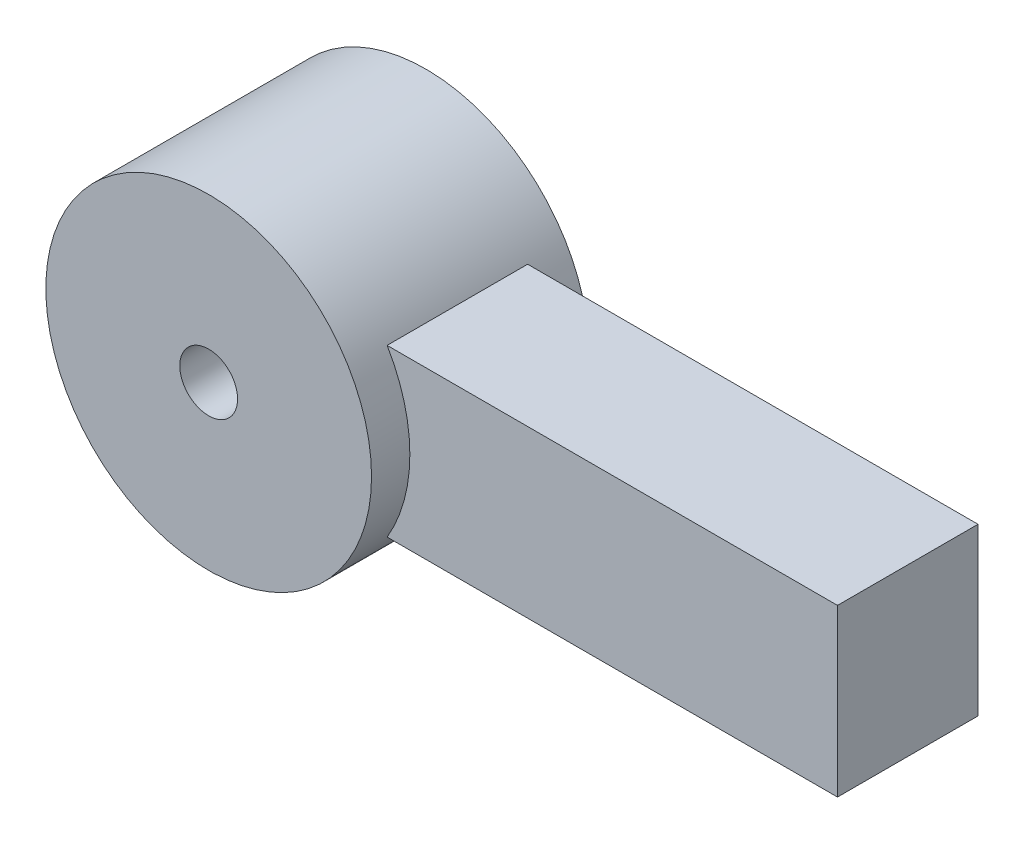
ISO-10303-21;
HEADER;
FILE_DESCRIPTION(('STEP AP214'),'2;1');
FILE_NAME('part.step','',(''),(''),'','','');
FILE_SCHEMA(('AUTOMOTIVE_DESIGN { 1 0 10303 214 1 1 1 1 }'));
ENDSEC;
DATA;
#1=APPLICATION_CONTEXT('core data for automotive mechanical design processes');
#2=APPLICATION_PROTOCOL_DEFINITION('international standard','automotive_design',2000,#1);
#3=PRODUCT_CONTEXT('',#1,'mechanical');
#4=PRODUCT('Part','Part','',(#3));
#5=PRODUCT_RELATED_PRODUCT_CATEGORY('part','',(#4));
#6=PRODUCT_DEFINITION_FORMATION('','',#4);
#7=PRODUCT_DEFINITION_CONTEXT('part definition',#1,'design');
#8=PRODUCT_DEFINITION('design','',#6,#7);
#9=PRODUCT_DEFINITION_SHAPE('','',#8);
#10=(LENGTH_UNIT() NAMED_UNIT(*) SI_UNIT(.MILLI.,.METRE.));
#11=(NAMED_UNIT(*) PLANE_ANGLE_UNIT() SI_UNIT($,.RADIAN.));
#12=(NAMED_UNIT(*) SI_UNIT($,.STERADIAN.) SOLID_ANGLE_UNIT());
#13=UNCERTAINTY_MEASURE_WITH_UNIT(LENGTH_MEASURE(1.E-05),#10,'distance_accuracy_value','');
#14=(GEOMETRIC_REPRESENTATION_CONTEXT(3) GLOBAL_UNCERTAINTY_ASSIGNED_CONTEXT((#13)) GLOBAL_UNIT_ASSIGNED_CONTEXT((#10,
#11,#12)) REPRESENTATION_CONTEXT('',''));
#15=CARTESIAN_POINT('',(0.,0.,0.));
#16=DIRECTION('',(0.,0.,1.));
#17=DIRECTION('',(1.,0.,0.));
#18=AXIS2_PLACEMENT_3D('',#15,#16,#17);
#19=CARTESIAN_POINT('',(0.,-6.49820958857563,5.5));
#20=DIRECTION('',(0.,-1.,0.));
#21=DIRECTION('',(0.,0.,-1.));
#22=AXIS2_PLACEMENT_3D('',#19,#20,#21);
#23=PLANE('',#22);
#24=DIRECTION('',(-1.,0.,0.));
#25=VECTOR('',#24,1.);
#26=CARTESIAN_POINT('',(0.,-6.49820958857563,-5.5));
#27=LINE('',#26,#25);
#28=CARTESIAN_POINT('',(46.2262412800929,-6.49820958857563,-5.5));
#29=VERTEX_POINT('',#28);
#30=CARTESIAN_POINT('',(10.9688194977699,-6.49820958857563,-5.5));
#31=VERTEX_POINT('',#30);
#32=EDGE_CURVE('E97',#29,#31,#27,.T.);
#33=ORIENTED_EDGE('',*,*,#32,.F.);
#34=DIRECTION('',(0.,0.,-1.));
#35=VECTOR('',#34,1.);
#36=CARTESIAN_POINT('',(46.2262412800929,-6.49820958857563,5.5));
#37=LINE('',#36,#35);
#38=CARTESIAN_POINT('',(46.2262412800929,-6.49820958857563,5.5));
#39=VERTEX_POINT('',#38);
#40=EDGE_CURVE('E45',#39,#29,#37,.T.);
#41=ORIENTED_EDGE('',*,*,#40,.F.);
#42=DIRECTION('',(-1.,0.,0.));
#43=VECTOR('',#42,1.);
#44=CARTESIAN_POINT('',(0.,-6.49820958857563,5.5));
#45=LINE('',#44,#43);
#46=CARTESIAN_POINT('',(10.9688194977699,-6.49820958857563,5.5));
#47=VERTEX_POINT('',#46);
#48=EDGE_CURVE('E111',#39,#47,#45,.T.);
#49=ORIENTED_EDGE('',*,*,#48,.T.);
#50=DIRECTION('',(0.,0.,-1.));
#51=VECTOR('',#50,1.);
#52=CARTESIAN_POINT('',(10.9688194977699,-6.49820958857563,5.5));
#53=LINE('',#52,#51);
#54=EDGE_CURVE('E11',#47,#31,#53,.T.);
#55=ORIENTED_EDGE('',*,*,#54,.T.);
#56=EDGE_LOOP('',(#33,#41,#49,#55));
#57=FACE_BOUND('',#56,.T.);
#58=ADVANCED_FACE('F37',(#57),#23,.T.);
#59=CARTESIAN_POINT('',(46.2262412800929,0.,5.5));
#60=DIRECTION('',(-1.,0.,0.));
#61=DIRECTION('',(0.,0.,1.));
#62=AXIS2_PLACEMENT_3D('',#59,#60,#61);
#63=PLANE('',#62);
#64=DIRECTION('',(0.,1.,0.));
#65=VECTOR('',#64,1.);
#66=CARTESIAN_POINT('',(46.2262412800929,0.,-5.5));
#67=LINE('',#66,#65);
#68=CARTESIAN_POINT('',(46.2262412800929,6.49820958857563,-5.5));
#69=VERTEX_POINT('',#68);
#70=EDGE_CURVE('E66',#29,#69,#67,.T.);
#71=ORIENTED_EDGE('',*,*,#70,.T.);
#72=DIRECTION('',(0.,0.,-1.));
#73=VECTOR('',#72,1.);
#74=CARTESIAN_POINT('',(46.2262412800929,6.49820958857563,5.5));
#75=LINE('',#74,#73);
#76=CARTESIAN_POINT('',(46.2262412800929,6.49820958857563,5.5));
#77=VERTEX_POINT('',#76);
#78=EDGE_CURVE('E86',#77,#69,#75,.T.);
#79=ORIENTED_EDGE('',*,*,#78,.F.);
#80=DIRECTION('',(0.,1.,0.));
#81=VECTOR('',#80,1.);
#82=CARTESIAN_POINT('',(46.2262412800929,0.,5.5));
#83=LINE('',#82,#81);
#84=EDGE_CURVE('E53',#39,#77,#83,.T.);
#85=ORIENTED_EDGE('',*,*,#84,.F.);
#86=ORIENTED_EDGE('',*,*,#40,.T.);
#87=EDGE_LOOP('',(#71,#79,#85,#86));
#88=FACE_BOUND('',#87,.T.);
#89=ADVANCED_FACE('F108',(#88),#63,.F.);
#90=CARTESIAN_POINT('',(0.,6.49820958857563,5.5));
#91=DIRECTION('',(0.,-1.,0.));
#92=DIRECTION('',(0.,0.,-1.));
#93=AXIS2_PLACEMENT_3D('',#90,#91,#92);
#94=PLANE('',#93);
#95=DIRECTION('',(-1.,0.,0.));
#96=VECTOR('',#95,1.);
#97=CARTESIAN_POINT('',(0.,6.49820958857563,-5.5));
#98=LINE('',#97,#96);
#99=CARTESIAN_POINT('',(10.9688194977699,6.49820958857563,-5.5));
#100=VERTEX_POINT('',#99);
#101=EDGE_CURVE('E90',#69,#100,#98,.T.);
#102=ORIENTED_EDGE('',*,*,#101,.T.);
#103=DIRECTION('',(0.,0.,-1.));
#104=VECTOR('',#103,1.);
#105=CARTESIAN_POINT('',(10.9688194977699,6.49820958857563,5.5));
#106=LINE('',#105,#104);
#107=CARTESIAN_POINT('',(10.9688194977699,6.49820958857563,5.5));
#108=VERTEX_POINT('',#107);
#109=EDGE_CURVE('E73',#108,#100,#106,.T.);
#110=ORIENTED_EDGE('',*,*,#109,.F.);
#111=DIRECTION('',(-1.,0.,0.));
#112=VECTOR('',#111,1.);
#113=CARTESIAN_POINT('',(0.,6.49820958857563,5.5));
#114=LINE('',#113,#112);
#115=EDGE_CURVE('E87',#77,#108,#114,.T.);
#116=ORIENTED_EDGE('',*,*,#115,.F.);
#117=ORIENTED_EDGE('',*,*,#78,.T.);
#118=EDGE_LOOP('',(#102,#110,#116,#117));
#119=FACE_BOUND('',#118,.T.);
#120=ADVANCED_FACE('F91',(#119),#94,.F.);
#121=CARTESIAN_POINT('',(0.,0.,5.5));
#122=DIRECTION('',(0.,0.,1.));
#123=DIRECTION('',(1.,0.,0.));
#124=AXIS2_PLACEMENT_3D('',#121,#122,#123);
#125=PLANE('',#124);
#126=CARTESIAN_POINT('',(0.,0.,5.5));
#127=DIRECTION('',(0.,0.,1.));
#128=DIRECTION('',(1.,0.,0.));
#129=AXIS2_PLACEMENT_3D('',#126,#127,#128);
#130=CIRCLE('',#129,12.7491854262032);
#131=EDGE_CURVE('E83',#47,#108,#130,.T.);
#132=ORIENTED_EDGE('',*,*,#131,.F.);
#133=ORIENTED_EDGE('',*,*,#48,.F.);
#134=ORIENTED_EDGE('',*,*,#84,.T.);
#135=ORIENTED_EDGE('',*,*,#115,.T.);
#136=EDGE_LOOP('',(#132,#133,#134,#135));
#137=FACE_BOUND('',#136,.T.);
#138=ADVANCED_FACE('F113',(#137),#125,.T.);
#139=CARTESIAN_POINT('',(0.,0.,-5.5));
#140=DIRECTION('',(0.,0.,1.));
#141=DIRECTION('',(1.,0.,0.));
#142=AXIS2_PLACEMENT_3D('',#139,#140,#141);
#143=PLANE('',#142);
#144=CARTESIAN_POINT('',(0.,0.,-5.5));
#145=DIRECTION('',(0.,0.,1.));
#146=DIRECTION('',(1.,0.,0.));
#147=AXIS2_PLACEMENT_3D('',#144,#145,#146);
#148=CIRCLE('',#147,12.7491854262032);
#149=EDGE_CURVE('E80',#31,#100,#148,.T.);
#150=ORIENTED_EDGE('',*,*,#149,.T.);
#151=ORIENTED_EDGE('',*,*,#101,.F.);
#152=ORIENTED_EDGE('',*,*,#70,.F.);
#153=ORIENTED_EDGE('',*,*,#32,.T.);
#154=EDGE_LOOP('',(#150,#151,#152,#153));
#155=FACE_BOUND('',#154,.T.);
#156=ADVANCED_FACE('F95',(#155),#143,.F.);
#157=CARTESIAN_POINT('',(0.,0.,8.5));
#158=DIRECTION('',(0.,0.,-1.));
#159=DIRECTION('',(-1.,0.,0.));
#160=AXIS2_PLACEMENT_3D('',#157,#158,#159);
#161=CYLINDRICAL_SURFACE('',#160,2.26163251067104);
#162=CARTESIAN_POINT('',(0.,0.,8.5));
#163=DIRECTION('',(0.,0.,1.));
#164=DIRECTION('',(1.,0.,0.));
#165=AXIS2_PLACEMENT_3D('',#162,#163,#164);
#166=CIRCLE('',#165,2.26163251067104);
#167=CARTESIAN_POINT('',(2.26163251067104,0.,8.5));
#168=VERTEX_POINT('',#167);
#169=EDGE_CURVE('E102',#168,#168,#166,.T.);
#170=ORIENTED_EDGE('',*,*,#169,.T.);
#171=EDGE_LOOP('',(#170));
#172=FACE_BOUND('',#171,.T.);
#173=CARTESIAN_POINT('',(0.,0.,-8.5));
#174=DIRECTION('',(0.,0.,1.));
#175=DIRECTION('',(1.,0.,0.));
#176=AXIS2_PLACEMENT_3D('',#173,#174,#175);
#177=CIRCLE('',#176,2.26163251067104);
#178=CARTESIAN_POINT('',(2.26163251067104,0.,-8.5));
#179=VERTEX_POINT('',#178);
#180=EDGE_CURVE('E120',#179,#179,#177,.T.);
#181=ORIENTED_EDGE('',*,*,#180,.F.);
#182=EDGE_LOOP('',(#181));
#183=FACE_BOUND('',#182,.T.);
#184=ADVANCED_FACE('F126',(#172,#183),#161,.F.);
#185=CARTESIAN_POINT('',(0.,0.,8.5));
#186=DIRECTION('',(0.,0.,-1.));
#187=DIRECTION('',(-1.,0.,0.));
#188=AXIS2_PLACEMENT_3D('',#185,#186,#187);
#189=CYLINDRICAL_SURFACE('',#188,12.7491854262032);
#190=ORIENTED_EDGE('',*,*,#131,.T.);
#191=ORIENTED_EDGE('',*,*,#109,.T.);
#192=ORIENTED_EDGE('',*,*,#149,.F.);
#193=ORIENTED_EDGE('',*,*,#54,.F.);
#194=EDGE_LOOP('',(#190,#191,#192,#193));
#195=FACE_BOUND('',#194,.T.);
#196=CARTESIAN_POINT('',(0.,0.,8.5));
#197=DIRECTION('',(0.,0.,1.));
#198=DIRECTION('',(1.,0.,0.));
#199=AXIS2_PLACEMENT_3D('',#196,#197,#198);
#200=CIRCLE('',#199,12.7491854262032);
#201=CARTESIAN_POINT('',(12.7491854262032,0.,8.5));
#202=VERTEX_POINT('',#201);
#203=EDGE_CURVE('E98',#202,#202,#200,.T.);
#204=ORIENTED_EDGE('',*,*,#203,.F.);
#205=EDGE_LOOP('',(#204));
#206=FACE_BOUND('',#205,.T.);
#207=CARTESIAN_POINT('',(0.,0.,-8.5));
#208=DIRECTION('',(0.,0.,1.));
#209=DIRECTION('',(1.,0.,0.));
#210=AXIS2_PLACEMENT_3D('',#207,#208,#209);
#211=CIRCLE('',#210,12.7491854262032);
#212=CARTESIAN_POINT('',(12.7491854262032,0.,-8.5));
#213=VERTEX_POINT('',#212);
#214=EDGE_CURVE('E117',#213,#213,#211,.T.);
#215=ORIENTED_EDGE('',*,*,#214,.T.);
#216=EDGE_LOOP('',(#215));
#217=FACE_BOUND('',#216,.T.);
#218=ADVANCED_FACE('F75',(#195,#206,#217),#189,.T.);
#219=CARTESIAN_POINT('',(0.,0.,8.5));
#220=DIRECTION('',(0.,0.,1.));
#221=DIRECTION('',(1.,0.,0.));
#222=AXIS2_PLACEMENT_3D('',#219,#220,#221);
#223=PLANE('',#222);
#224=ORIENTED_EDGE('',*,*,#169,.F.);
#225=EDGE_LOOP('',(#224));
#226=FACE_BOUND('',#225,.T.);
#227=ORIENTED_EDGE('',*,*,#203,.T.);
#228=EDGE_LOOP('',(#227));
#229=FACE_BOUND('',#228,.T.);
#230=ADVANCED_FACE('F129',(#226,#229),#223,.T.);
#231=CARTESIAN_POINT('',(0.,0.,-8.5));
#232=DIRECTION('',(0.,0.,1.));
#233=DIRECTION('',(1.,0.,0.));
#234=AXIS2_PLACEMENT_3D('',#231,#232,#233);
#235=PLANE('',#234);
#236=ORIENTED_EDGE('',*,*,#180,.T.);
#237=EDGE_LOOP('',(#236));
#238=FACE_BOUND('',#237,.T.);
#239=ORIENTED_EDGE('',*,*,#214,.F.);
#240=EDGE_LOOP('',(#239));
#241=FACE_BOUND('',#240,.T.);
#242=ADVANCED_FACE('F132',(#238,#241),#235,.F.);
#243=CLOSED_SHELL('',(#58,#89,#120,#138,#156,#184,#218,#230,#242));
#244=MANIFOLD_SOLID_BREP('B2',#243);
#245=ADVANCED_BREP_SHAPE_REPRESENTATION('',(#18,#244),#14);
#246=SHAPE_DEFINITION_REPRESENTATION(#9,#245);
ENDSEC;
END-ISO-10303-21;
